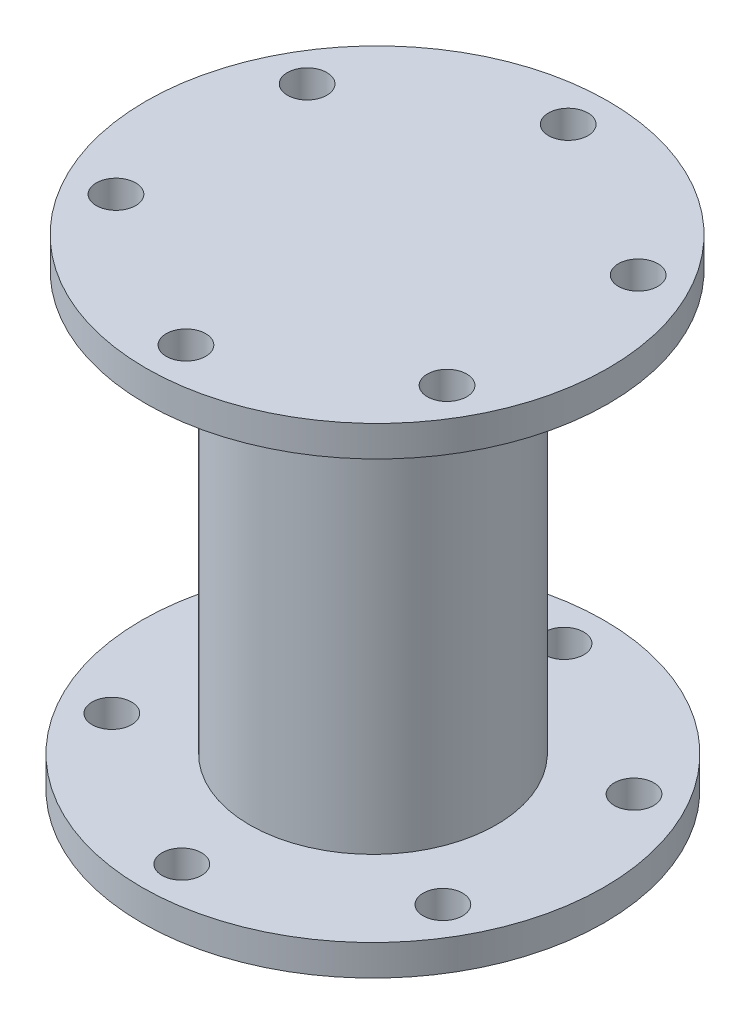
ISO-10303-21;
HEADER;
FILE_DESCRIPTION(('STEP AP214'),'2;1');
FILE_NAME('part.step','',(''),(''),'','','');
FILE_SCHEMA(('AUTOMOTIVE_DESIGN { 1 0 10303 214 1 1 1 1 }'));
ENDSEC;
DATA;
#1=APPLICATION_CONTEXT('core data for automotive mechanical design processes');
#2=APPLICATION_PROTOCOL_DEFINITION('international standard','automotive_design',2000,#1);
#3=PRODUCT_CONTEXT('',#1,'mechanical');
#4=PRODUCT('Part','Part','',(#3));
#5=PRODUCT_RELATED_PRODUCT_CATEGORY('part','',(#4));
#6=PRODUCT_DEFINITION_FORMATION('','',#4);
#7=PRODUCT_DEFINITION_CONTEXT('part definition',#1,'design');
#8=PRODUCT_DEFINITION('design','',#6,#7);
#9=PRODUCT_DEFINITION_SHAPE('','',#8);
#10=(LENGTH_UNIT() NAMED_UNIT(*) SI_UNIT(.MILLI.,.METRE.));
#11=(NAMED_UNIT(*) PLANE_ANGLE_UNIT() SI_UNIT($,.RADIAN.));
#12=(NAMED_UNIT(*) SI_UNIT($,.STERADIAN.) SOLID_ANGLE_UNIT());
#13=UNCERTAINTY_MEASURE_WITH_UNIT(LENGTH_MEASURE(1.E-05),#10,'distance_accuracy_value','');
#14=(GEOMETRIC_REPRESENTATION_CONTEXT(3) GLOBAL_UNCERTAINTY_ASSIGNED_CONTEXT((#13)) GLOBAL_UNIT_ASSIGNED_CONTEXT((#10,
#11,#12)) REPRESENTATION_CONTEXT('',''));
#15=CARTESIAN_POINT('',(0.,0.,0.));
#16=DIRECTION('',(0.,0.,1.));
#17=DIRECTION('',(1.,0.,0.));
#18=AXIS2_PLACEMENT_3D('',#15,#16,#17);
#19=CARTESIAN_POINT('',(0.,5.,0.));
#20=DIRECTION('',(0.,1.,0.));
#21=DIRECTION('',(0.,0.,1.));
#22=AXIS2_PLACEMENT_3D('',#19,#20,#21);
#23=PLANE('',#22);
#24=CARTESIAN_POINT('',(0.,5.,0.));
#25=DIRECTION('',(0.,1.,0.));
#26=DIRECTION('',(0.,0.,1.));
#27=AXIS2_PLACEMENT_3D('',#24,#25,#26);
#28=CIRCLE('',#27,20.);
#29=CARTESIAN_POINT('',(0.,5.,20.));
#30=VERTEX_POINT('',#29);
#31=EDGE_CURVE('E90',#30,#30,#28,.T.);
#32=ORIENTED_EDGE('',*,*,#31,.F.);
#33=EDGE_LOOP('',(#32));
#34=FACE_BOUND('',#33,.T.);
#35=CARTESIAN_POINT('',(-26.8467875173177,5.,15.4999999999997));
#36=DIRECTION('',(0.,1.,0.));
#37=DIRECTION('',(0.,0.,1.));
#38=AXIS2_PLACEMENT_3D('',#35,#36,#37);
#39=CIRCLE('',#38,3.2);
#40=CARTESIAN_POINT('',(-26.8467875173177,5.,18.6999999999997));
#41=VERTEX_POINT('',#40);
#42=EDGE_CURVE('E75',#41,#41,#39,.T.);
#43=ORIENTED_EDGE('',*,*,#42,.F.);
#44=EDGE_LOOP('',(#43));
#45=FACE_BOUND('',#44,.T.);
#46=CARTESIAN_POINT('',(26.8467875173175,5.,15.5000000000001));
#47=DIRECTION('',(0.,1.,0.));
#48=DIRECTION('',(0.,0.,1.));
#49=AXIS2_PLACEMENT_3D('',#46,#47,#48);
#50=CIRCLE('',#49,3.2);
#51=CARTESIAN_POINT('',(26.8467875173175,5.,18.7000000000001));
#52=VERTEX_POINT('',#51);
#53=EDGE_CURVE('E63',#52,#52,#50,.T.);
#54=ORIENTED_EDGE('',*,*,#53,.F.);
#55=EDGE_LOOP('',(#54));
#56=FACE_BOUND('',#55,.T.);
#57=CARTESIAN_POINT('',(0.,5.,-31.));
#58=DIRECTION('',(0.,1.,0.));
#59=DIRECTION('',(0.,0.,1.));
#60=AXIS2_PLACEMENT_3D('',#57,#58,#59);
#61=CIRCLE('',#60,3.2);
#62=CARTESIAN_POINT('',(0.,5.,-27.8));
#63=VERTEX_POINT('',#62);
#64=EDGE_CURVE('E52',#63,#63,#61,.T.);
#65=ORIENTED_EDGE('',*,*,#64,.F.);
#66=EDGE_LOOP('',(#65));
#67=FACE_BOUND('',#66,.T.);
#68=CARTESIAN_POINT('',(0.,5.,0.));
#69=DIRECTION('',(0.,1.,0.));
#70=DIRECTION('',(0.,0.,1.));
#71=AXIS2_PLACEMENT_3D('',#68,#69,#70);
#72=CIRCLE('',#71,37.5);
#73=CARTESIAN_POINT('',(0.,5.,37.5));
#74=VERTEX_POINT('',#73);
#75=EDGE_CURVE('E10',#74,#74,#72,.T.);
#76=ORIENTED_EDGE('',*,*,#75,.T.);
#77=EDGE_LOOP('',(#76));
#78=FACE_BOUND('',#77,.T.);
#79=CARTESIAN_POINT('',(26.8467875173176,5.,-15.4999999999999));
#80=DIRECTION('',(0.,1.,0.));
#81=DIRECTION('',(0.,0.,1.));
#82=AXIS2_PLACEMENT_3D('',#79,#80,#81);
#83=CIRCLE('',#82,3.2);
#84=CARTESIAN_POINT('',(26.8467875173176,5.,-12.2999999999999));
#85=VERTEX_POINT('',#84);
#86=EDGE_CURVE('E57',#85,#85,#83,.T.);
#87=ORIENTED_EDGE('',*,*,#86,.F.);
#88=EDGE_LOOP('',(#87));
#89=FACE_BOUND('',#88,.T.);
#90=CARTESIAN_POINT('',(-2.16471843008274E-13,5.,31.));
#91=DIRECTION('',(0.,1.,0.));
#92=DIRECTION('',(0.,0.,1.));
#93=AXIS2_PLACEMENT_3D('',#90,#91,#92);
#94=CIRCLE('',#93,3.2);
#95=CARTESIAN_POINT('',(-2.16471843008274E-13,5.,34.2));
#96=VERTEX_POINT('',#95);
#97=EDGE_CURVE('E69',#96,#96,#94,.T.);
#98=ORIENTED_EDGE('',*,*,#97,.F.);
#99=EDGE_LOOP('',(#98));
#100=FACE_BOUND('',#99,.T.);
#101=CARTESIAN_POINT('',(-26.8467875173174,5.,-15.5000000000003));
#102=DIRECTION('',(0.,1.,0.));
#103=DIRECTION('',(0.,0.,1.));
#104=AXIS2_PLACEMENT_3D('',#101,#102,#103);
#105=CIRCLE('',#104,3.2);
#106=CARTESIAN_POINT('',(-26.8467875173174,5.,-12.3000000000003));
#107=VERTEX_POINT('',#106);
#108=EDGE_CURVE('E81',#107,#107,#105,.T.);
#109=ORIENTED_EDGE('',*,*,#108,.F.);
#110=EDGE_LOOP('',(#109));
#111=FACE_BOUND('',#110,.T.);
#112=ADVANCED_FACE('F41',(#34,#45,#56,#67,#78,#89,#100,#111),#23,.T.);
#113=CARTESIAN_POINT('',(0.,0.,0.));
#114=DIRECTION('',(0.,1.,0.));
#115=DIRECTION('',(0.,0.,1.));
#116=AXIS2_PLACEMENT_3D('',#113,#114,#115);
#117=PLANE('',#116);
#118=CARTESIAN_POINT('',(0.,0.,0.));
#119=DIRECTION('',(0.,1.,0.));
#120=DIRECTION('',(0.,0.,1.));
#121=AXIS2_PLACEMENT_3D('',#118,#119,#120);
#122=CIRCLE('',#121,37.5);
#123=CARTESIAN_POINT('',(0.,0.,37.5));
#124=VERTEX_POINT('',#123);
#125=EDGE_CURVE('E45',#124,#124,#122,.T.);
#126=ORIENTED_EDGE('',*,*,#125,.F.);
#127=EDGE_LOOP('',(#126));
#128=FACE_BOUND('',#127,.T.);
#129=CARTESIAN_POINT('',(0.,0.,-31.));
#130=DIRECTION('',(0.,1.,0.));
#131=DIRECTION('',(0.,0.,1.));
#132=AXIS2_PLACEMENT_3D('',#129,#130,#131);
#133=CIRCLE('',#132,3.2);
#134=CARTESIAN_POINT('',(0.,0.,-27.8));
#135=VERTEX_POINT('',#134);
#136=EDGE_CURVE('E54',#135,#135,#133,.T.);
#137=ORIENTED_EDGE('',*,*,#136,.T.);
#138=EDGE_LOOP('',(#137));
#139=FACE_BOUND('',#138,.T.);
#140=CARTESIAN_POINT('',(26.8467875173176,0.,-15.4999999999999));
#141=DIRECTION('',(0.,1.,0.));
#142=DIRECTION('',(0.,0.,1.));
#143=AXIS2_PLACEMENT_3D('',#140,#141,#142);
#144=CIRCLE('',#143,3.2);
#145=CARTESIAN_POINT('',(26.8467875173176,0.,-12.2999999999999));
#146=VERTEX_POINT('',#145);
#147=EDGE_CURVE('E60',#146,#146,#144,.T.);
#148=ORIENTED_EDGE('',*,*,#147,.T.);
#149=EDGE_LOOP('',(#148));
#150=FACE_BOUND('',#149,.T.);
#151=CARTESIAN_POINT('',(26.8467875173175,0.,15.5000000000001));
#152=DIRECTION('',(0.,1.,0.));
#153=DIRECTION('',(0.,0.,1.));
#154=AXIS2_PLACEMENT_3D('',#151,#152,#153);
#155=CIRCLE('',#154,3.2);
#156=CARTESIAN_POINT('',(26.8467875173175,0.,18.7000000000001));
#157=VERTEX_POINT('',#156);
#158=EDGE_CURVE('E66',#157,#157,#155,.T.);
#159=ORIENTED_EDGE('',*,*,#158,.T.);
#160=EDGE_LOOP('',(#159));
#161=FACE_BOUND('',#160,.T.);
#162=CARTESIAN_POINT('',(-2.16471843008274E-13,0.,31.));
#163=DIRECTION('',(0.,1.,0.));
#164=DIRECTION('',(0.,0.,1.));
#165=AXIS2_PLACEMENT_3D('',#162,#163,#164);
#166=CIRCLE('',#165,3.2);
#167=CARTESIAN_POINT('',(-2.16471843008274E-13,0.,34.2));
#168=VERTEX_POINT('',#167);
#169=EDGE_CURVE('E72',#168,#168,#166,.T.);
#170=ORIENTED_EDGE('',*,*,#169,.T.);
#171=EDGE_LOOP('',(#170));
#172=FACE_BOUND('',#171,.T.);
#173=CARTESIAN_POINT('',(-26.8467875173177,0.,15.4999999999997));
#174=DIRECTION('',(0.,1.,0.));
#175=DIRECTION('',(0.,0.,1.));
#176=AXIS2_PLACEMENT_3D('',#173,#174,#175);
#177=CIRCLE('',#176,3.2);
#178=CARTESIAN_POINT('',(-26.8467875173177,0.,18.6999999999997));
#179=VERTEX_POINT('',#178);
#180=EDGE_CURVE('E78',#179,#179,#177,.T.);
#181=ORIENTED_EDGE('',*,*,#180,.T.);
#182=EDGE_LOOP('',(#181));
#183=FACE_BOUND('',#182,.T.);
#184=CARTESIAN_POINT('',(-26.8467875173174,0.,-15.5000000000003));
#185=DIRECTION('',(0.,1.,0.));
#186=DIRECTION('',(0.,0.,1.));
#187=AXIS2_PLACEMENT_3D('',#184,#185,#186);
#188=CIRCLE('',#187,3.2);
#189=CARTESIAN_POINT('',(-26.8467875173174,0.,-12.3000000000003));
#190=VERTEX_POINT('',#189);
#191=EDGE_CURVE('E84',#190,#190,#188,.T.);
#192=ORIENTED_EDGE('',*,*,#191,.T.);
#193=EDGE_LOOP('',(#192));
#194=FACE_BOUND('',#193,.T.);
#195=ADVANCED_FACE('F161',(#128,#139,#150,#161,#172,#183,#194),#117,.F.);
#196=CARTESIAN_POINT('',(0.,5.,0.));
#197=DIRECTION('',(0.,-1.,0.));
#198=DIRECTION('',(0.,0.,-1.));
#199=AXIS2_PLACEMENT_3D('',#196,#197,#198);
#200=CYLINDRICAL_SURFACE('',#199,37.5);
#201=ORIENTED_EDGE('',*,*,#75,.F.);
#202=EDGE_LOOP('',(#201));
#203=FACE_BOUND('',#202,.T.);
#204=ORIENTED_EDGE('',*,*,#125,.T.);
#205=EDGE_LOOP('',(#204));
#206=FACE_BOUND('',#205,.T.);
#207=ADVANCED_FACE('F43',(#203,#206),#200,.T.);
#208=CARTESIAN_POINT('',(0.,5.,-31.));
#209=DIRECTION('',(0.,-1.,0.));
#210=DIRECTION('',(0.,0.,-1.));
#211=AXIS2_PLACEMENT_3D('',#208,#209,#210);
#212=CYLINDRICAL_SURFACE('',#211,3.2);
#213=ORIENTED_EDGE('',*,*,#64,.T.);
#214=EDGE_LOOP('',(#213));
#215=FACE_BOUND('',#214,.T.);
#216=ORIENTED_EDGE('',*,*,#136,.F.);
#217=EDGE_LOOP('',(#216));
#218=FACE_BOUND('',#217,.T.);
#219=ADVANCED_FACE('F171',(#215,#218),#212,.F.);
#220=CARTESIAN_POINT('',(26.8467875173176,5.,-15.4999999999999));
#221=DIRECTION('',(0.,-1.,0.));
#222=DIRECTION('',(0.,0.,-1.));
#223=AXIS2_PLACEMENT_3D('',#220,#221,#222);
#224=CYLINDRICAL_SURFACE('',#223,3.2);
#225=ORIENTED_EDGE('',*,*,#86,.T.);
#226=EDGE_LOOP('',(#225));
#227=FACE_BOUND('',#226,.T.);
#228=ORIENTED_EDGE('',*,*,#147,.F.);
#229=EDGE_LOOP('',(#228));
#230=FACE_BOUND('',#229,.T.);
#231=ADVANCED_FACE('F174',(#227,#230),#224,.F.);
#232=CARTESIAN_POINT('',(26.8467875173175,5.,15.5000000000001));
#233=DIRECTION('',(0.,-1.,0.));
#234=DIRECTION('',(0.,0.,-1.));
#235=AXIS2_PLACEMENT_3D('',#232,#233,#234);
#236=CYLINDRICAL_SURFACE('',#235,3.2);
#237=ORIENTED_EDGE('',*,*,#53,.T.);
#238=EDGE_LOOP('',(#237));
#239=FACE_BOUND('',#238,.T.);
#240=ORIENTED_EDGE('',*,*,#158,.F.);
#241=EDGE_LOOP('',(#240));
#242=FACE_BOUND('',#241,.T.);
#243=ADVANCED_FACE('F178',(#239,#242),#236,.F.);
#244=CARTESIAN_POINT('',(-2.16471843008274E-13,5.,31.));
#245=DIRECTION('',(0.,-1.,0.));
#246=DIRECTION('',(0.,0.,-1.));
#247=AXIS2_PLACEMENT_3D('',#244,#245,#246);
#248=CYLINDRICAL_SURFACE('',#247,3.2);
#249=ORIENTED_EDGE('',*,*,#97,.T.);
#250=EDGE_LOOP('',(#249));
#251=FACE_BOUND('',#250,.T.);
#252=ORIENTED_EDGE('',*,*,#169,.F.);
#253=EDGE_LOOP('',(#252));
#254=FACE_BOUND('',#253,.T.);
#255=ADVANCED_FACE('F182',(#251,#254),#248,.F.);
#256=CARTESIAN_POINT('',(-26.8467875173177,5.,15.4999999999997));
#257=DIRECTION('',(0.,-1.,0.));
#258=DIRECTION('',(0.,0.,-1.));
#259=AXIS2_PLACEMENT_3D('',#256,#257,#258);
#260=CYLINDRICAL_SURFACE('',#259,3.2);
#261=ORIENTED_EDGE('',*,*,#42,.T.);
#262=EDGE_LOOP('',(#261));
#263=FACE_BOUND('',#262,.T.);
#264=ORIENTED_EDGE('',*,*,#180,.F.);
#265=EDGE_LOOP('',(#264));
#266=FACE_BOUND('',#265,.T.);
#267=ADVANCED_FACE('F186',(#263,#266),#260,.F.);
#268=CARTESIAN_POINT('',(-26.8467875173174,5.,-15.5000000000003));
#269=DIRECTION('',(0.,-1.,0.));
#270=DIRECTION('',(0.,0.,-1.));
#271=AXIS2_PLACEMENT_3D('',#268,#269,#270);
#272=CYLINDRICAL_SURFACE('',#271,3.2);
#273=ORIENTED_EDGE('',*,*,#108,.T.);
#274=EDGE_LOOP('',(#273));
#275=FACE_BOUND('',#274,.T.);
#276=ORIENTED_EDGE('',*,*,#191,.F.);
#277=EDGE_LOOP('',(#276));
#278=FACE_BOUND('',#277,.T.);
#279=ADVANCED_FACE('F154',(#275,#278),#272,.F.);
#280=CARTESIAN_POINT('',(0.,73.,0.));
#281=DIRECTION('',(0.,-1.,0.));
#282=DIRECTION('',(0.,0.,-1.));
#283=AXIS2_PLACEMENT_3D('',#280,#281,#282);
#284=CYLINDRICAL_SURFACE('',#283,20.);
#285=CARTESIAN_POINT('',(0.,73.,0.));
#286=DIRECTION('',(0.,1.,0.));
#287=DIRECTION('',(0.,0.,1.));
#288=AXIS2_PLACEMENT_3D('',#285,#286,#287);
#289=CIRCLE('',#288,20.);
#290=CARTESIAN_POINT('',(0.,73.,20.));
#291=VERTEX_POINT('',#290);
#292=EDGE_CURVE('E87',#291,#291,#289,.T.);
#293=ORIENTED_EDGE('',*,*,#292,.F.);
#294=EDGE_LOOP('',(#293));
#295=FACE_BOUND('',#294,.T.);
#296=ORIENTED_EDGE('',*,*,#31,.T.);
#297=EDGE_LOOP('',(#296));
#298=FACE_BOUND('',#297,.T.);
#299=ADVANCED_FACE('F144',(#295,#298),#284,.T.);
#300=CARTESIAN_POINT('',(0.421553843466427,78.,-0.25055593482648));
#301=DIRECTION('',(0.,1.,0.));
#302=DIRECTION('',(0.,0.,1.));
#303=AXIS2_PLACEMENT_3D('',#300,#301,#302);
#304=PLANE('',#303);
#305=CARTESIAN_POINT('',(-26.4252336738513,78.,15.2494440651733));
#306=DIRECTION('',(0.,1.,0.));
#307=DIRECTION('',(0.,0.,1.));
#308=AXIS2_PLACEMENT_3D('',#305,#306,#307);
#309=CIRCLE('',#308,3.2);
#310=CARTESIAN_POINT('',(-26.4252336738513,78.,18.4494440651733));
#311=VERTEX_POINT('',#310);
#312=EDGE_CURVE('E123',#311,#311,#309,.T.);
#313=ORIENTED_EDGE('',*,*,#312,.F.);
#314=EDGE_LOOP('',(#313));
#315=FACE_BOUND('',#314,.T.);
#316=CARTESIAN_POINT('',(27.268341360784,78.,15.2494440651736));
#317=DIRECTION('',(0.,1.,0.));
#318=DIRECTION('',(0.,0.,1.));
#319=AXIS2_PLACEMENT_3D('',#316,#317,#318);
#320=CIRCLE('',#319,3.2);
#321=CARTESIAN_POINT('',(27.268341360784,78.,18.4494440651737));
#322=VERTEX_POINT('',#321);
#323=EDGE_CURVE('E111',#322,#322,#320,.T.);
#324=ORIENTED_EDGE('',*,*,#323,.F.);
#325=EDGE_LOOP('',(#324));
#326=FACE_BOUND('',#325,.T.);
#327=CARTESIAN_POINT('',(0.421553843466427,78.,-31.2505559348265));
#328=DIRECTION('',(0.,1.,0.));
#329=DIRECTION('',(0.,0.,1.));
#330=AXIS2_PLACEMENT_3D('',#327,#328,#329);
#331=CIRCLE('',#330,3.2);
#332=CARTESIAN_POINT('',(0.421553843466427,78.,-28.0505559348265));
#333=VERTEX_POINT('',#332);
#334=EDGE_CURVE('E99',#333,#333,#331,.T.);
#335=ORIENTED_EDGE('',*,*,#334,.F.);
#336=EDGE_LOOP('',(#335));
#337=FACE_BOUND('',#336,.T.);
#338=CARTESIAN_POINT('',(0.421553843466427,78.,-0.25055593482648));
#339=DIRECTION('',(0.,1.,0.));
#340=DIRECTION('',(0.,0.,1.));
#341=AXIS2_PLACEMENT_3D('',#338,#339,#340);
#342=CIRCLE('',#341,37.5);
#343=CARTESIAN_POINT('',(0.421553843466427,78.,37.2494440651735));
#344=VERTEX_POINT('',#343);
#345=EDGE_CURVE('E93',#344,#344,#342,.T.);
#346=ORIENTED_EDGE('',*,*,#345,.T.);
#347=EDGE_LOOP('',(#346));
#348=FACE_BOUND('',#347,.T.);
#349=CARTESIAN_POINT('',(27.2683413607841,78.,-15.7505559348264));
#350=DIRECTION('',(0.,1.,0.));
#351=DIRECTION('',(0.,0.,1.));
#352=AXIS2_PLACEMENT_3D('',#349,#350,#351);
#353=CIRCLE('',#352,3.2);
#354=CARTESIAN_POINT('',(27.2683413607841,78.,-12.5505559348264));
#355=VERTEX_POINT('',#354);
#356=EDGE_CURVE('E105',#355,#355,#353,.T.);
#357=ORIENTED_EDGE('',*,*,#356,.F.);
#358=EDGE_LOOP('',(#357));
#359=FACE_BOUND('',#358,.T.);
#360=CARTESIAN_POINT('',(0.42155384346621,78.,30.7494440651735));
#361=DIRECTION('',(0.,1.,0.));
#362=DIRECTION('',(0.,0.,1.));
#363=AXIS2_PLACEMENT_3D('',#360,#361,#362);
#364=CIRCLE('',#363,3.2);
#365=CARTESIAN_POINT('',(0.42155384346621,78.,33.9494440651735));
#366=VERTEX_POINT('',#365);
#367=EDGE_CURVE('E117',#366,#366,#364,.T.);
#368=ORIENTED_EDGE('',*,*,#367,.F.);
#369=EDGE_LOOP('',(#368));
#370=FACE_BOUND('',#369,.T.);
#371=CARTESIAN_POINT('',(-26.425233673851,78.,-15.7505559348268));
#372=DIRECTION('',(0.,1.,0.));
#373=DIRECTION('',(0.,0.,1.));
#374=AXIS2_PLACEMENT_3D('',#371,#372,#373);
#375=CIRCLE('',#374,3.2);
#376=CARTESIAN_POINT('',(-26.425233673851,78.,-12.5505559348268));
#377=VERTEX_POINT('',#376);
#378=EDGE_CURVE('E129',#377,#377,#375,.T.);
#379=ORIENTED_EDGE('',*,*,#378,.F.);
#380=EDGE_LOOP('',(#379));
#381=FACE_BOUND('',#380,.T.);
#382=ADVANCED_FACE('F141',(#315,#326,#337,#348,#359,#370,#381),#304,.T.);
#383=CARTESIAN_POINT('',(0.421553843466427,73.,-0.25055593482648));
#384=DIRECTION('',(0.,1.,0.));
#385=DIRECTION('',(0.,0.,1.));
#386=AXIS2_PLACEMENT_3D('',#383,#384,#385);
#387=PLANE('',#386);
#388=ORIENTED_EDGE('',*,*,#292,.T.);
#389=EDGE_LOOP('',(#388));
#390=FACE_BOUND('',#389,.T.);
#391=CARTESIAN_POINT('',(0.421553843466427,73.,-0.25055593482648));
#392=DIRECTION('',(0.,1.,0.));
#393=DIRECTION('',(0.,0.,1.));
#394=AXIS2_PLACEMENT_3D('',#391,#392,#393);
#395=CIRCLE('',#394,37.5);
#396=CARTESIAN_POINT('',(0.421553843466427,73.,37.2494440651735));
#397=VERTEX_POINT('',#396);
#398=EDGE_CURVE('E96',#397,#397,#395,.T.);
#399=ORIENTED_EDGE('',*,*,#398,.F.);
#400=EDGE_LOOP('',(#399));
#401=FACE_BOUND('',#400,.T.);
#402=CARTESIAN_POINT('',(0.421553843466427,73.,-31.2505559348265));
#403=DIRECTION('',(0.,1.,0.));
#404=DIRECTION('',(0.,0.,1.));
#405=AXIS2_PLACEMENT_3D('',#402,#403,#404);
#406=CIRCLE('',#405,3.2);
#407=CARTESIAN_POINT('',(0.421553843466427,73.,-28.0505559348265));
#408=VERTEX_POINT('',#407);
#409=EDGE_CURVE('E102',#408,#408,#406,.T.);
#410=ORIENTED_EDGE('',*,*,#409,.T.);
#411=EDGE_LOOP('',(#410));
#412=FACE_BOUND('',#411,.T.);
#413=CARTESIAN_POINT('',(27.2683413607841,73.,-15.7505559348264));
#414=DIRECTION('',(0.,1.,0.));
#415=DIRECTION('',(0.,0.,1.));
#416=AXIS2_PLACEMENT_3D('',#413,#414,#415);
#417=CIRCLE('',#416,3.2);
#418=CARTESIAN_POINT('',(27.2683413607841,73.,-12.5505559348264));
#419=VERTEX_POINT('',#418);
#420=EDGE_CURVE('E108',#419,#419,#417,.T.);
#421=ORIENTED_EDGE('',*,*,#420,.T.);
#422=EDGE_LOOP('',(#421));
#423=FACE_BOUND('',#422,.T.);
#424=CARTESIAN_POINT('',(27.268341360784,73.,15.2494440651736));
#425=DIRECTION('',(0.,1.,0.));
#426=DIRECTION('',(0.,0.,1.));
#427=AXIS2_PLACEMENT_3D('',#424,#425,#426);
#428=CIRCLE('',#427,3.2);
#429=CARTESIAN_POINT('',(27.268341360784,73.,18.4494440651737));
#430=VERTEX_POINT('',#429);
#431=EDGE_CURVE('E114',#430,#430,#428,.T.);
#432=ORIENTED_EDGE('',*,*,#431,.T.);
#433=EDGE_LOOP('',(#432));
#434=FACE_BOUND('',#433,.T.);
#435=CARTESIAN_POINT('',(0.42155384346621,73.,30.7494440651735));
#436=DIRECTION('',(0.,1.,0.));
#437=DIRECTION('',(0.,0.,1.));
#438=AXIS2_PLACEMENT_3D('',#435,#436,#437);
#439=CIRCLE('',#438,3.2);
#440=CARTESIAN_POINT('',(0.42155384346621,73.,33.9494440651735));
#441=VERTEX_POINT('',#440);
#442=EDGE_CURVE('E120',#441,#441,#439,.T.);
#443=ORIENTED_EDGE('',*,*,#442,.T.);
#444=EDGE_LOOP('',(#443));
#445=FACE_BOUND('',#444,.T.);
#446=CARTESIAN_POINT('',(-26.4252336738513,73.,15.2494440651733));
#447=DIRECTION('',(0.,1.,0.));
#448=DIRECTION('',(0.,0.,1.));
#449=AXIS2_PLACEMENT_3D('',#446,#447,#448);
#450=CIRCLE('',#449,3.2);
#451=CARTESIAN_POINT('',(-26.4252336738513,73.,18.4494440651733));
#452=VERTEX_POINT('',#451);
#453=EDGE_CURVE('E126',#452,#452,#450,.T.);
#454=ORIENTED_EDGE('',*,*,#453,.T.);
#455=EDGE_LOOP('',(#454));
#456=FACE_BOUND('',#455,.T.);
#457=CARTESIAN_POINT('',(-26.425233673851,73.,-15.7505559348268));
#458=DIRECTION('',(0.,1.,0.));
#459=DIRECTION('',(0.,0.,1.));
#460=AXIS2_PLACEMENT_3D('',#457,#458,#459);
#461=CIRCLE('',#460,3.2);
#462=CARTESIAN_POINT('',(-26.425233673851,73.,-12.5505559348268));
#463=VERTEX_POINT('',#462);
#464=EDGE_CURVE('E132',#463,#463,#461,.T.);
#465=ORIENTED_EDGE('',*,*,#464,.T.);
#466=EDGE_LOOP('',(#465));
#467=FACE_BOUND('',#466,.T.);
#468=ADVANCED_FACE('F143',(#390,#401,#412,#423,#434,#445,#456,#467),#387,.F.);
#469=CARTESIAN_POINT('',(0.421553843466427,78.,-0.25055593482648));
#470=DIRECTION('',(0.,-1.,0.));
#471=DIRECTION('',(0.,0.,-1.));
#472=AXIS2_PLACEMENT_3D('',#469,#470,#471);
#473=CYLINDRICAL_SURFACE('',#472,37.5);
#474=ORIENTED_EDGE('',*,*,#345,.F.);
#475=EDGE_LOOP('',(#474));
#476=FACE_BOUND('',#475,.T.);
#477=ORIENTED_EDGE('',*,*,#398,.T.);
#478=EDGE_LOOP('',(#477));
#479=FACE_BOUND('',#478,.T.);
#480=ADVANCED_FACE('F151',(#476,#479),#473,.T.);
#481=CARTESIAN_POINT('',(0.421553843466427,78.,-31.2505559348265));
#482=DIRECTION('',(0.,-1.,0.));
#483=DIRECTION('',(0.,0.,-1.));
#484=AXIS2_PLACEMENT_3D('',#481,#482,#483);
#485=CYLINDRICAL_SURFACE('',#484,3.2);
#486=ORIENTED_EDGE('',*,*,#334,.T.);
#487=EDGE_LOOP('',(#486));
#488=FACE_BOUND('',#487,.T.);
#489=ORIENTED_EDGE('',*,*,#409,.F.);
#490=EDGE_LOOP('',(#489));
#491=FACE_BOUND('',#490,.T.);
#492=ADVANCED_FACE('F195',(#488,#491),#485,.F.);
#493=CARTESIAN_POINT('',(27.2683413607841,78.,-15.7505559348264));
#494=DIRECTION('',(0.,-1.,0.));
#495=DIRECTION('',(0.,0.,-1.));
#496=AXIS2_PLACEMENT_3D('',#493,#494,#495);
#497=CYLINDRICAL_SURFACE('',#496,3.2);
#498=ORIENTED_EDGE('',*,*,#356,.T.);
#499=EDGE_LOOP('',(#498));
#500=FACE_BOUND('',#499,.T.);
#501=ORIENTED_EDGE('',*,*,#420,.F.);
#502=EDGE_LOOP('',(#501));
#503=FACE_BOUND('',#502,.T.);
#504=ADVANCED_FACE('F200',(#500,#503),#497,.F.);
#505=CARTESIAN_POINT('',(27.268341360784,78.,15.2494440651736));
#506=DIRECTION('',(0.,-1.,0.));
#507=DIRECTION('',(0.,0.,-1.));
#508=AXIS2_PLACEMENT_3D('',#505,#506,#507);
#509=CYLINDRICAL_SURFACE('',#508,3.2);
#510=ORIENTED_EDGE('',*,*,#323,.T.);
#511=EDGE_LOOP('',(#510));
#512=FACE_BOUND('',#511,.T.);
#513=ORIENTED_EDGE('',*,*,#431,.F.);
#514=EDGE_LOOP('',(#513));
#515=FACE_BOUND('',#514,.T.);
#516=ADVANCED_FACE('F230',(#512,#515),#509,.F.);
#517=CARTESIAN_POINT('',(0.42155384346621,78.,30.7494440651735));
#518=DIRECTION('',(0.,-1.,0.));
#519=DIRECTION('',(0.,0.,-1.));
#520=AXIS2_PLACEMENT_3D('',#517,#518,#519);
#521=CYLINDRICAL_SURFACE('',#520,3.2);
#522=ORIENTED_EDGE('',*,*,#367,.T.);
#523=EDGE_LOOP('',(#522));
#524=FACE_BOUND('',#523,.T.);
#525=ORIENTED_EDGE('',*,*,#442,.F.);
#526=EDGE_LOOP('',(#525));
#527=FACE_BOUND('',#526,.T.);
#528=ADVANCED_FACE('F224',(#524,#527),#521,.F.);
#529=CARTESIAN_POINT('',(-26.4252336738513,78.,15.2494440651733));
#530=DIRECTION('',(0.,-1.,0.));
#531=DIRECTION('',(0.,0.,-1.));
#532=AXIS2_PLACEMENT_3D('',#529,#530,#531);
#533=CYLINDRICAL_SURFACE('',#532,3.2);
#534=ORIENTED_EDGE('',*,*,#312,.T.);
#535=EDGE_LOOP('',(#534));
#536=FACE_BOUND('',#535,.T.);
#537=ORIENTED_EDGE('',*,*,#453,.F.);
#538=EDGE_LOOP('',(#537));
#539=FACE_BOUND('',#538,.T.);
#540=ADVANCED_FACE('F219',(#536,#539),#533,.F.);
#541=CARTESIAN_POINT('',(-26.425233673851,78.,-15.7505559348268));
#542=DIRECTION('',(0.,-1.,0.));
#543=DIRECTION('',(0.,0.,-1.));
#544=AXIS2_PLACEMENT_3D('',#541,#542,#543);
#545=CYLINDRICAL_SURFACE('',#544,3.2);
#546=ORIENTED_EDGE('',*,*,#378,.T.);
#547=EDGE_LOOP('',(#546));
#548=FACE_BOUND('',#547,.T.);
#549=ORIENTED_EDGE('',*,*,#464,.F.);
#550=EDGE_LOOP('',(#549));
#551=FACE_BOUND('',#550,.T.);
#552=ADVANCED_FACE('F138',(#548,#551),#545,.F.);
#553=CLOSED_SHELL('',(#112,#195,#207,#219,#231,#243,#255,#267,#279,#299,#382,#468,#480,#492,
#504,#516,#528,#540,#552));
#554=MANIFOLD_SOLID_BREP('B2',#553);
#555=ADVANCED_BREP_SHAPE_REPRESENTATION('',(#18,#554),#14);
#556=SHAPE_DEFINITION_REPRESENTATION(#9,#555);
ENDSEC;
END-ISO-10303-21;
